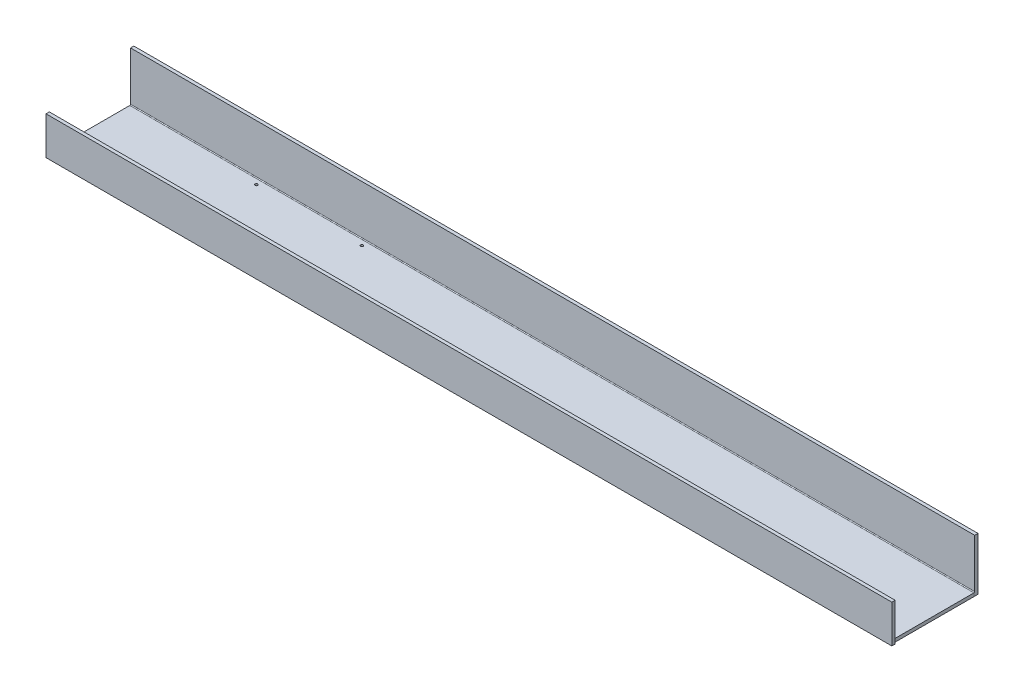
ISO-10303-21;
HEADER;
FILE_DESCRIPTION(('STEP AP214'),'2;1');
FILE_NAME('part.step','',(''),(''),'','','');
FILE_SCHEMA(('AUTOMOTIVE_DESIGN { 1 0 10303 214 1 1 1 1 }'));
ENDSEC;
DATA;
#1=APPLICATION_CONTEXT('core data for automotive mechanical design processes');
#2=APPLICATION_PROTOCOL_DEFINITION('international standard','automotive_design',2000,#1);
#3=PRODUCT_CONTEXT('',#1,'mechanical');
#4=PRODUCT('Part','Part','',(#3));
#5=PRODUCT_RELATED_PRODUCT_CATEGORY('part','',(#4));
#6=PRODUCT_DEFINITION_FORMATION('','',#4);
#7=PRODUCT_DEFINITION_CONTEXT('part definition',#1,'design');
#8=PRODUCT_DEFINITION('design','',#6,#7);
#9=PRODUCT_DEFINITION_SHAPE('','',#8);
#10=(LENGTH_UNIT() NAMED_UNIT(*) SI_UNIT(.MILLI.,.METRE.));
#11=(NAMED_UNIT(*) PLANE_ANGLE_UNIT() SI_UNIT($,.RADIAN.));
#12=(NAMED_UNIT(*) SI_UNIT($,.STERADIAN.) SOLID_ANGLE_UNIT());
#13=UNCERTAINTY_MEASURE_WITH_UNIT(LENGTH_MEASURE(1.E-05),#10,'distance_accuracy_value','');
#14=(GEOMETRIC_REPRESENTATION_CONTEXT(3) GLOBAL_UNCERTAINTY_ASSIGNED_CONTEXT((#13)) GLOBAL_UNIT_ASSIGNED_CONTEXT((#10,
#11,#12)) REPRESENTATION_CONTEXT('',''));
#15=CARTESIAN_POINT('',(0.,0.,0.));
#16=DIRECTION('',(0.,0.,1.));
#17=DIRECTION('',(1.,0.,0.));
#18=AXIS2_PLACEMENT_3D('',#15,#16,#17);
#19=CARTESIAN_POINT('',(812.8,3.937,-0.761999999999999));
#20=DIRECTION('',(-1.,0.,0.));
#21=DIRECTION('',(0.,0.,1.));
#22=AXIS2_PLACEMENT_3D('',#19,#20,#21);
#23=PLANE('',#22);
#24=CARTESIAN_POINT('',(812.8,3.937,-0.761999999999999));
#25=DIRECTION('',(1.,0.,0.));
#26=DIRECTION('',(0.,0.,-1.));
#27=AXIS2_PLACEMENT_3D('',#24,#25,#26);
#28=CIRCLE('',#27,0.761999999999999);
#29=CARTESIAN_POINT('',(812.8,3.937,0.));
#30=VERTEX_POINT('',#29);
#31=CARTESIAN_POINT('',(812.8,3.175,-0.761999999999999));
#32=VERTEX_POINT('',#31);
#33=EDGE_CURVE('E259',#30,#32,#28,.T.);
#34=ORIENTED_EDGE('',*,*,#33,.F.);
#35=DIRECTION('',(0.,1.,0.));
#36=VECTOR('',#35,1.);
#37=CARTESIAN_POINT('',(812.8,3.937,0.));
#38=LINE('',#37,#36);
#39=CARTESIAN_POINT('',(812.8,0.0744457932606293,0.));
#40=VERTEX_POINT('',#39);
#41=EDGE_CURVE('E197',#30,#40,#38,.F.);
#42=ORIENTED_EDGE('',*,*,#41,.T.);
#43=CARTESIAN_POINT('',(812.8,3.937,-0.761999999999999));
#44=DIRECTION('',(1.,0.,0.));
#45=DIRECTION('',(0.,0.,-1.));
#46=AXIS2_PLACEMENT_3D('',#43,#44,#45);
#47=CIRCLE('',#46,3.937);
#48=CARTESIAN_POINT('',(812.8,0.,-0.761999999999998));
#49=VERTEX_POINT('',#48);
#50=EDGE_CURVE('E265',#40,#49,#47,.T.);
#51=ORIENTED_EDGE('',*,*,#50,.T.);
#52=DIRECTION('',(0.,-1.,0.));
#53=VECTOR('',#52,1.);
#54=CARTESIAN_POINT('',(812.8,3.175,-0.761999999999999));
#55=LINE('',#54,#53);
#56=EDGE_CURVE('E268',#32,#49,#55,.T.);
#57=ORIENTED_EDGE('',*,*,#56,.F.);
#58=EDGE_LOOP('',(#34,#42,#51,#57));
#59=FACE_BOUND('',#58,.T.);
#60=ADVANCED_FACE('F39',(#59),#23,.F.);
#61=CARTESIAN_POINT('',(812.8,3.937,-0.761999999999999));
#62=DIRECTION('',(1.,0.,0.));
#63=DIRECTION('',(0.,0.,1.));
#64=AXIS2_PLACEMENT_3D('',#61,#62,#63);
#65=CYLINDRICAL_SURFACE('',#64,3.937);
#66=ORIENTED_EDGE('',*,*,#50,.F.);
#67=DIRECTION('',(1.,0.,0.));
#68=VECTOR('',#67,1.);
#69=CARTESIAN_POINT('',(812.8,0.0744457932606293,0.));
#70=LINE('',#69,#68);
#71=CARTESIAN_POINT('',(0.,0.0744457932606293,0.));
#72=VERTEX_POINT('',#71);
#73=EDGE_CURVE('E190',#40,#72,#70,.F.);
#74=ORIENTED_EDGE('',*,*,#73,.T.);
#75=CARTESIAN_POINT('',(0.,3.937,-0.761999999999999));
#76=DIRECTION('',(1.,0.,0.));
#77=DIRECTION('',(0.,0.,-1.));
#78=AXIS2_PLACEMENT_3D('',#75,#76,#77);
#79=CIRCLE('',#78,3.937);
#80=CARTESIAN_POINT('',(0.,0.,-0.761999999999998));
#81=VERTEX_POINT('',#80);
#82=EDGE_CURVE('E264',#81,#72,#79,.F.);
#83=ORIENTED_EDGE('',*,*,#82,.F.);
#84=DIRECTION('',(1.,0.,0.));
#85=VECTOR('',#84,1.);
#86=CARTESIAN_POINT('',(812.8,0.,-0.761999999999998));
#87=LINE('',#86,#85);
#88=EDGE_CURVE('E261',#49,#81,#87,.F.);
#89=ORIENTED_EDGE('',*,*,#88,.F.);
#90=EDGE_LOOP('',(#66,#74,#83,#89));
#91=FACE_BOUND('',#90,.T.);
#92=ADVANCED_FACE('F333',(#91),#65,.T.);
#93=CARTESIAN_POINT('',(0.,3.175,-78.232));
#94=DIRECTION('',(0.,-1.,0.));
#95=DIRECTION('',(0.,0.,-1.));
#96=AXIS2_PLACEMENT_3D('',#93,#94,#95);
#97=PLANE('',#96);
#98=CARTESIAN_POINT('',(127.,3.175,-5.84200000000001));
#99=DIRECTION('',(0.,1.,0.));
#100=DIRECTION('',(0.,0.,1.));
#101=AXIS2_PLACEMENT_3D('',#98,#99,#100);
#102=CIRCLE('',#101,1.27);
#103=CARTESIAN_POINT('',(127.,3.175,-4.57200000000001));
#104=VERTEX_POINT('',#103);
#105=EDGE_CURVE('E230',#104,#104,#102,.T.);
#106=ORIENTED_EDGE('',*,*,#105,.F.);
#107=EDGE_LOOP('',(#106));
#108=FACE_BOUND('',#107,.T.);
#109=CARTESIAN_POINT('',(228.6,3.175,-5.84200000000001));
#110=DIRECTION('',(0.,1.,0.));
#111=DIRECTION('',(0.,0.,1.));
#112=AXIS2_PLACEMENT_3D('',#109,#110,#111);
#113=CIRCLE('',#112,1.26999999999997);
#114=CARTESIAN_POINT('',(228.6,3.175,-4.57200000000004));
#115=VERTEX_POINT('',#114);
#116=EDGE_CURVE('E234',#115,#115,#113,.T.);
#117=ORIENTED_EDGE('',*,*,#116,.F.);
#118=EDGE_LOOP('',(#117));
#119=FACE_BOUND('',#118,.T.);
#120=CARTESIAN_POINT('',(228.6,3.175,-72.39));
#121=DIRECTION('',(0.,1.,0.));
#122=DIRECTION('',(0.,0.,1.));
#123=AXIS2_PLACEMENT_3D('',#120,#121,#122);
#124=CIRCLE('',#123,1.26999999999998);
#125=CARTESIAN_POINT('',(228.6,3.175,-71.12));
#126=VERTEX_POINT('',#125);
#127=EDGE_CURVE('E240',#126,#126,#124,.T.);
#128=ORIENTED_EDGE('',*,*,#127,.F.);
#129=EDGE_LOOP('',(#128));
#130=FACE_BOUND('',#129,.T.);
#131=CARTESIAN_POINT('',(127.,3.175,-72.39));
#132=DIRECTION('',(0.,1.,0.));
#133=DIRECTION('',(0.,0.,1.));
#134=AXIS2_PLACEMENT_3D('',#131,#132,#133);
#135=CIRCLE('',#134,1.27000000000001);
#136=CARTESIAN_POINT('',(127.,3.175,-71.12));
#137=VERTEX_POINT('',#136);
#138=EDGE_CURVE('E246',#137,#137,#135,.T.);
#139=ORIENTED_EDGE('',*,*,#138,.F.);
#140=EDGE_LOOP('',(#139));
#141=FACE_BOUND('',#140,.T.);
#142=DIRECTION('',(1.,0.,0.));
#143=VECTOR('',#142,1.);
#144=CARTESIAN_POINT('',(812.8,3.175,-0.761999999999999));
#145=LINE('',#144,#143);
#146=CARTESIAN_POINT('',(0.,3.175,-0.761999999999999));
#147=VERTEX_POINT('',#146);
#148=EDGE_CURVE('E273',#32,#147,#145,.F.);
#149=ORIENTED_EDGE('',*,*,#148,.F.);
#150=DIRECTION('',(0.,0.,-1.));
#151=VECTOR('',#150,1.);
#152=CARTESIAN_POINT('',(812.8,3.175,0.));
#153=LINE('',#152,#151);
#154=CARTESIAN_POINT('',(812.8,3.17499999999999,-77.47));
#155=VERTEX_POINT('',#154);
#156=EDGE_CURVE('E11',#32,#155,#153,.T.);
#157=ORIENTED_EDGE('',*,*,#156,.T.);
#158=DIRECTION('',(-1.,0.,0.));
#159=VECTOR('',#158,1.);
#160=CARTESIAN_POINT('',(0.,3.17499999999999,-77.47));
#161=LINE('',#160,#159);
#162=CARTESIAN_POINT('',(2.22044604925031E-13,3.17499999999999,-77.47));
#163=VERTEX_POINT('',#162);
#164=EDGE_CURVE('E303',#163,#155,#161,.F.);
#165=ORIENTED_EDGE('',*,*,#164,.F.);
#166=DIRECTION('',(0.,0.,1.));
#167=VECTOR('',#166,1.);
#168=CARTESIAN_POINT('',(0.,3.175,0.));
#169=LINE('',#168,#167);
#170=EDGE_CURVE('E48',#163,#147,#169,.T.);
#171=ORIENTED_EDGE('',*,*,#170,.T.);
#172=EDGE_LOOP('',(#149,#157,#165,#171));
#173=FACE_BOUND('',#172,.T.);
#174=ADVANCED_FACE('F342',(#108,#119,#130,#141,#173),#97,.F.);
#175=CARTESIAN_POINT('',(0.,0.,-78.232));
#176=DIRECTION('',(0.,-1.,0.));
#177=DIRECTION('',(0.,0.,-1.));
#178=AXIS2_PLACEMENT_3D('',#175,#176,#177);
#179=PLANE('',#178);
#180=CARTESIAN_POINT('',(127.,0.,-5.84200000000001));
#181=DIRECTION('',(0.,1.,0.));
#182=DIRECTION('',(0.,0.,1.));
#183=AXIS2_PLACEMENT_3D('',#180,#181,#182);
#184=CIRCLE('',#183,1.27);
#185=CARTESIAN_POINT('',(127.,0.,-4.57200000000001));
#186=VERTEX_POINT('',#185);
#187=EDGE_CURVE('E231',#186,#186,#184,.T.);
#188=ORIENTED_EDGE('',*,*,#187,.T.);
#189=EDGE_LOOP('',(#188));
#190=FACE_BOUND('',#189,.T.);
#191=CARTESIAN_POINT('',(228.6,0.,-5.84200000000001));
#192=DIRECTION('',(0.,1.,0.));
#193=DIRECTION('',(0.,0.,1.));
#194=AXIS2_PLACEMENT_3D('',#191,#192,#193);
#195=CIRCLE('',#194,1.26999999999997);
#196=CARTESIAN_POINT('',(228.6,0.,-4.57200000000004));
#197=VERTEX_POINT('',#196);
#198=EDGE_CURVE('E237',#197,#197,#195,.T.);
#199=ORIENTED_EDGE('',*,*,#198,.T.);
#200=EDGE_LOOP('',(#199));
#201=FACE_BOUND('',#200,.T.);
#202=CARTESIAN_POINT('',(228.6,0.,-72.39));
#203=DIRECTION('',(0.,1.,0.));
#204=DIRECTION('',(0.,0.,1.));
#205=AXIS2_PLACEMENT_3D('',#202,#203,#204);
#206=CIRCLE('',#205,1.26999999999998);
#207=CARTESIAN_POINT('',(228.6,0.,-71.12));
#208=VERTEX_POINT('',#207);
#209=EDGE_CURVE('E243',#208,#208,#206,.T.);
#210=ORIENTED_EDGE('',*,*,#209,.T.);
#211=EDGE_LOOP('',(#210));
#212=FACE_BOUND('',#211,.T.);
#213=CARTESIAN_POINT('',(127.,0.,-72.39));
#214=DIRECTION('',(0.,1.,0.));
#215=DIRECTION('',(0.,0.,1.));
#216=AXIS2_PLACEMENT_3D('',#213,#214,#215);
#217=CIRCLE('',#216,1.27000000000001);
#218=CARTESIAN_POINT('',(127.,0.,-71.12));
#219=VERTEX_POINT('',#218);
#220=EDGE_CURVE('E249',#219,#219,#217,.T.);
#221=ORIENTED_EDGE('',*,*,#220,.T.);
#222=EDGE_LOOP('',(#221));
#223=FACE_BOUND('',#222,.T.);
#224=DIRECTION('',(0.,0.,-1.));
#225=VECTOR('',#224,1.);
#226=CARTESIAN_POINT('',(812.8,0.,-78.232));
#227=LINE('',#226,#225);
#228=CARTESIAN_POINT('',(812.8,0.,-77.47));
#229=VERTEX_POINT('',#228);
#230=EDGE_CURVE('E43',#49,#229,#227,.T.);
#231=ORIENTED_EDGE('',*,*,#230,.F.);
#232=ORIENTED_EDGE('',*,*,#88,.T.);
#233=DIRECTION('',(0.,0.,-1.));
#234=VECTOR('',#233,1.);
#235=CARTESIAN_POINT('',(0.,0.,-78.232));
#236=LINE('',#235,#234);
#237=CARTESIAN_POINT('',(2.22044604925031E-13,0.,-77.47));
#238=VERTEX_POINT('',#237);
#239=EDGE_CURVE('E311',#238,#81,#236,.F.);
#240=ORIENTED_EDGE('',*,*,#239,.F.);
#241=DIRECTION('',(-1.,0.,0.));
#242=VECTOR('',#241,1.);
#243=CARTESIAN_POINT('',(0.,0.,-77.47));
#244=LINE('',#243,#242);
#245=EDGE_CURVE('E293',#238,#229,#244,.F.);
#246=ORIENTED_EDGE('',*,*,#245,.T.);
#247=EDGE_LOOP('',(#231,#232,#240,#246));
#248=FACE_BOUND('',#247,.T.);
#249=ADVANCED_FACE('F329',(#190,#201,#212,#223,#248),#179,.T.);
#250=CARTESIAN_POINT('',(812.8,3.175,0.));
#251=DIRECTION('',(-1.,0.,0.));
#252=DIRECTION('',(0.,0.,-1.));
#253=AXIS2_PLACEMENT_3D('',#250,#251,#252);
#254=PLANE('',#253);
#255=ORIENTED_EDGE('',*,*,#156,.F.);
#256=ORIENTED_EDGE('',*,*,#56,.T.);
#257=ORIENTED_EDGE('',*,*,#230,.T.);
#258=DIRECTION('',(0.,-1.,0.));
#259=VECTOR('',#258,1.);
#260=CARTESIAN_POINT('',(812.8,3.17499999999999,-77.47));
#261=LINE('',#260,#259);
#262=EDGE_CURVE('E308',#155,#229,#261,.T.);
#263=ORIENTED_EDGE('',*,*,#262,.F.);
#264=EDGE_LOOP('',(#255,#256,#257,#263));
#265=FACE_BOUND('',#264,.T.);
#266=ADVANCED_FACE('F41',(#265),#254,.F.);
#267=CARTESIAN_POINT('',(0.,3.175,0.));
#268=DIRECTION('',(1.,0.,0.));
#269=DIRECTION('',(0.,0.,1.));
#270=AXIS2_PLACEMENT_3D('',#267,#268,#269);
#271=PLANE('',#270);
#272=DIRECTION('',(0.,-1.,0.));
#273=VECTOR('',#272,1.);
#274=CARTESIAN_POINT('',(0.,3.175,-0.761999999999999));
#275=LINE('',#274,#273);
#276=EDGE_CURVE('E277',#147,#81,#275,.T.);
#277=ORIENTED_EDGE('',*,*,#276,.F.);
#278=ORIENTED_EDGE('',*,*,#170,.F.);
#279=DIRECTION('',(0.,-1.,0.));
#280=VECTOR('',#279,1.);
#281=CARTESIAN_POINT('',(2.22044604925031E-13,3.17499999999999,-77.47));
#282=LINE('',#281,#280);
#283=EDGE_CURVE('E298',#163,#238,#282,.T.);
#284=ORIENTED_EDGE('',*,*,#283,.T.);
#285=ORIENTED_EDGE('',*,*,#239,.T.);
#286=EDGE_LOOP('',(#277,#278,#284,#285));
#287=FACE_BOUND('',#286,.T.);
#288=ADVANCED_FACE('F338',(#287),#271,.F.);
#289=CARTESIAN_POINT('',(812.8,3.93699999999998,-77.47));
#290=DIRECTION('',(1.,0.,0.));
#291=DIRECTION('',(0.,0.,-1.));
#292=AXIS2_PLACEMENT_3D('',#289,#290,#291);
#293=PLANE('',#292);
#294=CARTESIAN_POINT('',(812.8,3.93699999999998,-77.47));
#295=DIRECTION('',(-1.,0.,0.));
#296=DIRECTION('',(0.,0.,1.));
#297=AXIS2_PLACEMENT_3D('',#294,#295,#296);
#298=CIRCLE('',#297,3.937);
#299=CARTESIAN_POINT('',(812.8,0.0744457932606128,-78.232));
#300=VERTEX_POINT('',#299);
#301=EDGE_CURVE('E296',#229,#300,#298,.F.);
#302=ORIENTED_EDGE('',*,*,#301,.T.);
#303=DIRECTION('',(0.,-1.,0.));
#304=VECTOR('',#303,1.);
#305=CARTESIAN_POINT('',(812.8,0.,-78.232));
#306=LINE('',#305,#304);
#307=CARTESIAN_POINT('',(812.8,0.,-78.232));
#308=VERTEX_POINT('',#307);
#309=EDGE_CURVE('E201',#300,#308,#306,.T.);
#310=ORIENTED_EDGE('',*,*,#309,.T.);
#311=DIRECTION('',(0.,0.,-1.));
#312=VECTOR('',#311,1.);
#313=CARTESIAN_POINT('',(812.8,0.,-78.232));
#314=LINE('',#313,#312);
#315=CARTESIAN_POINT('',(812.8,0.,-81.407));
#316=VERTEX_POINT('',#315);
#317=EDGE_CURVE('E213',#308,#316,#314,.T.);
#318=ORIENTED_EDGE('',*,*,#317,.T.);
#319=DIRECTION('',(0.,-1.,0.));
#320=VECTOR('',#319,1.);
#321=CARTESIAN_POINT('',(812.8,3.17499999999999,-81.407));
#322=LINE('',#321,#320);
#323=CARTESIAN_POINT('',(812.8,50.8,-81.4070000000002));
#324=VERTEX_POINT('',#323);
#325=EDGE_CURVE('E285',#324,#316,#322,.T.);
#326=ORIENTED_EDGE('',*,*,#325,.F.);
#327=DIRECTION('',(0.,0.,-1.));
#328=VECTOR('',#327,1.);
#329=CARTESIAN_POINT('',(812.8,50.8,-78.2320000000002));
#330=LINE('',#329,#328);
#331=CARTESIAN_POINT('',(812.8,50.8,-78.2320000000002));
#332=VERTEX_POINT('',#331);
#333=EDGE_CURVE('E218',#332,#324,#330,.T.);
#334=ORIENTED_EDGE('',*,*,#333,.F.);
#335=DIRECTION('',(0.,-1.,0.));
#336=VECTOR('',#335,1.);
#337=CARTESIAN_POINT('',(812.8,3.175,-78.232));
#338=LINE('',#337,#336);
#339=CARTESIAN_POINT('',(812.8,3.93699999999998,-78.232));
#340=VERTEX_POINT('',#339);
#341=EDGE_CURVE('E284',#332,#340,#338,.T.);
#342=ORIENTED_EDGE('',*,*,#341,.T.);
#343=CARTESIAN_POINT('',(812.8,3.93699999999998,-77.47));
#344=DIRECTION('',(-1.,0.,0.));
#345=DIRECTION('',(0.,0.,1.));
#346=AXIS2_PLACEMENT_3D('',#343,#344,#345);
#347=CIRCLE('',#346,0.761999999999999);
#348=EDGE_CURVE('E300',#155,#340,#347,.F.);
#349=ORIENTED_EDGE('',*,*,#348,.F.);
#350=ORIENTED_EDGE('',*,*,#262,.T.);
#351=EDGE_LOOP('',(#302,#310,#318,#326,#334,#342,#349,#350));
#352=FACE_BOUND('',#351,.T.);
#353=ADVANCED_FACE('F328',(#352),#293,.T.);
#354=CARTESIAN_POINT('',(2.22044604925031E-13,3.93699999999998,-77.47));
#355=DIRECTION('',(1.,0.,0.));
#356=DIRECTION('',(0.,0.,-1.));
#357=AXIS2_PLACEMENT_3D('',#354,#355,#356);
#358=PLANE('',#357);
#359=CARTESIAN_POINT('',(2.22044604925031E-13,3.93699999999998,-77.47));
#360=DIRECTION('',(-1.,0.,0.));
#361=DIRECTION('',(0.,0.,1.));
#362=AXIS2_PLACEMENT_3D('',#359,#360,#361);
#363=CIRCLE('',#362,0.761999999999999);
#364=CARTESIAN_POINT('',(2.22044604925031E-13,3.93699999999998,-78.232));
#365=VERTEX_POINT('',#364);
#366=EDGE_CURVE('E290',#365,#163,#363,.T.);
#367=ORIENTED_EDGE('',*,*,#366,.F.);
#368=DIRECTION('',(0.,1.,0.));
#369=VECTOR('',#368,1.);
#370=CARTESIAN_POINT('',(0.,26.543,-78.2320000000001));
#371=LINE('',#370,#369);
#372=CARTESIAN_POINT('',(0.,50.8,-78.2320000000002));
#373=VERTEX_POINT('',#372);
#374=EDGE_CURVE('E288',#365,#373,#371,.T.);
#375=ORIENTED_EDGE('',*,*,#374,.T.);
#376=DIRECTION('',(0.,0.,-1.));
#377=VECTOR('',#376,1.);
#378=CARTESIAN_POINT('',(0.,50.8,-78.2320000000002));
#379=LINE('',#378,#377);
#380=CARTESIAN_POINT('',(0.,50.8,-81.4070000000002));
#381=VERTEX_POINT('',#380);
#382=EDGE_CURVE('E221',#373,#381,#379,.T.);
#383=ORIENTED_EDGE('',*,*,#382,.T.);
#384=DIRECTION('',(0.,1.,0.));
#385=VECTOR('',#384,1.);
#386=CARTESIAN_POINT('',(0.,26.543,-81.4070000000001));
#387=LINE('',#386,#385);
#388=CARTESIAN_POINT('',(0.,0.,-81.407));
#389=VERTEX_POINT('',#388);
#390=EDGE_CURVE('E287',#389,#381,#387,.T.);
#391=ORIENTED_EDGE('',*,*,#390,.F.);
#392=DIRECTION('',(0.,0.,-1.));
#393=VECTOR('',#392,1.);
#394=CARTESIAN_POINT('',(0.,0.,-78.232));
#395=LINE('',#394,#393);
#396=CARTESIAN_POINT('',(0.,0.,-78.232));
#397=VERTEX_POINT('',#396);
#398=EDGE_CURVE('E224',#397,#389,#395,.T.);
#399=ORIENTED_EDGE('',*,*,#398,.F.);
#400=DIRECTION('',(0.,1.,0.));
#401=VECTOR('',#400,1.);
#402=CARTESIAN_POINT('',(0.,0.,-78.232));
#403=LINE('',#402,#401);
#404=CARTESIAN_POINT('',(2.22044604925031E-13,0.0744457932606128,-78.232));
#405=VERTEX_POINT('',#404);
#406=EDGE_CURVE('E207',#397,#405,#403,.T.);
#407=ORIENTED_EDGE('',*,*,#406,.T.);
#408=CARTESIAN_POINT('',(2.22044604925031E-13,3.93699999999998,-77.47));
#409=DIRECTION('',(-1.,0.,0.));
#410=DIRECTION('',(0.,0.,1.));
#411=AXIS2_PLACEMENT_3D('',#408,#409,#410);
#412=CIRCLE('',#411,3.937);
#413=EDGE_CURVE('E61',#405,#238,#412,.T.);
#414=ORIENTED_EDGE('',*,*,#413,.T.);
#415=ORIENTED_EDGE('',*,*,#283,.F.);
#416=EDGE_LOOP('',(#367,#375,#383,#391,#399,#407,#414,#415));
#417=FACE_BOUND('',#416,.T.);
#418=ADVANCED_FACE('F349',(#417),#358,.F.);
#419=CARTESIAN_POINT('',(0.,3.93699999999998,-77.47));
#420=DIRECTION('',(-1.,0.,0.));
#421=DIRECTION('',(0.,0.,-1.));
#422=AXIS2_PLACEMENT_3D('',#419,#420,#421);
#423=CYLINDRICAL_SURFACE('',#422,3.937);
#424=DIRECTION('',(-1.,0.,0.));
#425=VECTOR('',#424,1.);
#426=CARTESIAN_POINT('',(0.,0.0744457932606128,-78.232));
#427=LINE('',#426,#425);
#428=EDGE_CURVE('E56',#300,#405,#427,.T.);
#429=ORIENTED_EDGE('',*,*,#428,.F.);
#430=ORIENTED_EDGE('',*,*,#301,.F.);
#431=ORIENTED_EDGE('',*,*,#245,.F.);
#432=ORIENTED_EDGE('',*,*,#413,.F.);
#433=EDGE_LOOP('',(#429,#430,#431,#432));
#434=FACE_BOUND('',#433,.T.);
#435=ADVANCED_FACE('F324',(#434),#423,.T.);
#436=CARTESIAN_POINT('',(0.,3.93699999999998,-77.47));
#437=DIRECTION('',(-1.,0.,0.));
#438=DIRECTION('',(0.,0.,-1.));
#439=AXIS2_PLACEMENT_3D('',#436,#437,#438);
#440=CYLINDRICAL_SURFACE('',#439,0.761999999999999);
#441=ORIENTED_EDGE('',*,*,#164,.T.);
#442=ORIENTED_EDGE('',*,*,#348,.T.);
#443=DIRECTION('',(-1.,0.,0.));
#444=VECTOR('',#443,1.);
#445=CARTESIAN_POINT('',(812.8,3.937,-78.232));
#446=LINE('',#445,#444);
#447=EDGE_CURVE('E280',#340,#365,#446,.T.);
#448=ORIENTED_EDGE('',*,*,#447,.T.);
#449=ORIENTED_EDGE('',*,*,#366,.T.);
#450=EDGE_LOOP('',(#441,#442,#448,#449));
#451=FACE_BOUND('',#450,.T.);
#452=ADVANCED_FACE('F344',(#451),#440,.F.);
#453=CARTESIAN_POINT('',(812.8,26.543,-81.4070000000001));
#454=DIRECTION('',(0.,0.,1.));
#455=DIRECTION('',(0.,-1.,0.));
#456=AXIS2_PLACEMENT_3D('',#453,#454,#455);
#457=PLANE('',#456);
#458=ORIENTED_EDGE('',*,*,#390,.T.);
#459=DIRECTION('',(1.,0.,0.));
#460=VECTOR('',#459,1.);
#461=CARTESIAN_POINT('',(812.8,50.8,-81.4070000000002));
#462=LINE('',#461,#460);
#463=EDGE_CURVE('E204',#381,#324,#462,.T.);
#464=ORIENTED_EDGE('',*,*,#463,.T.);
#465=ORIENTED_EDGE('',*,*,#325,.T.);
#466=DIRECTION('',(-1.,0.,0.));
#467=VECTOR('',#466,1.);
#468=CARTESIAN_POINT('',(812.8,0.,-81.407));
#469=LINE('',#468,#467);
#470=EDGE_CURVE('E200',#316,#389,#469,.T.);
#471=ORIENTED_EDGE('',*,*,#470,.T.);
#472=EDGE_LOOP('',(#458,#464,#465,#471));
#473=FACE_BOUND('',#472,.T.);
#474=ADVANCED_FACE('F365',(#473),#457,.F.);
#475=CARTESIAN_POINT('',(812.8,26.543,-78.2320000000001));
#476=DIRECTION('',(0.,0.,1.));
#477=DIRECTION('',(0.,-1.,0.));
#478=AXIS2_PLACEMENT_3D('',#475,#476,#477);
#479=PLANE('',#478);
#480=DIRECTION('',(1.,0.,0.));
#481=VECTOR('',#480,1.);
#482=CARTESIAN_POINT('',(812.8,50.8,-78.2320000000002));
#483=LINE('',#482,#481);
#484=EDGE_CURVE('E210',#373,#332,#483,.T.);
#485=ORIENTED_EDGE('',*,*,#484,.F.);
#486=ORIENTED_EDGE('',*,*,#374,.F.);
#487=ORIENTED_EDGE('',*,*,#447,.F.);
#488=ORIENTED_EDGE('',*,*,#341,.F.);
#489=EDGE_LOOP('',(#485,#486,#487,#488));
#490=FACE_BOUND('',#489,.T.);
#491=ADVANCED_FACE('F353',(#490),#479,.T.);
#492=CARTESIAN_POINT('',(0.,3.937,-0.761999999999999));
#493=DIRECTION('',(-1.,0.,0.));
#494=DIRECTION('',(0.,0.,1.));
#495=AXIS2_PLACEMENT_3D('',#492,#493,#494);
#496=PLANE('',#495);
#497=DIRECTION('',(0.,0.,1.));
#498=VECTOR('',#497,1.);
#499=CARTESIAN_POINT('',(0.,0.,0.));
#500=LINE('',#499,#498);
#501=CARTESIAN_POINT('',(0.,0.,0.));
#502=VERTEX_POINT('',#501);
#503=CARTESIAN_POINT('',(0.,0.,3.175));
#504=VERTEX_POINT('',#503);
#505=EDGE_CURVE('E191',#502,#504,#500,.T.);
#506=ORIENTED_EDGE('',*,*,#505,.T.);
#507=DIRECTION('',(0.,-1.,0.));
#508=VECTOR('',#507,1.);
#509=CARTESIAN_POINT('',(0.,3.175,3.175));
#510=LINE('',#509,#508);
#511=CARTESIAN_POINT('',(2.22044604925031E-13,36.576,3.175));
#512=VERTEX_POINT('',#511);
#513=EDGE_CURVE('E257',#512,#504,#510,.T.);
#514=ORIENTED_EDGE('',*,*,#513,.F.);
#515=DIRECTION('',(0.,0.,1.));
#516=VECTOR('',#515,1.);
#517=CARTESIAN_POINT('',(2.22044604925031E-13,36.576,0.));
#518=LINE('',#517,#516);
#519=CARTESIAN_POINT('',(2.22044604925031E-13,36.576,0.));
#520=VERTEX_POINT('',#519);
#521=EDGE_CURVE('E163',#520,#512,#518,.T.);
#522=ORIENTED_EDGE('',*,*,#521,.F.);
#523=DIRECTION('',(0.,-1.,0.));
#524=VECTOR('',#523,1.);
#525=CARTESIAN_POINT('',(0.,3.175,0.));
#526=LINE('',#525,#524);
#527=CARTESIAN_POINT('',(0.,3.937,0.));
#528=VERTEX_POINT('',#527);
#529=EDGE_CURVE('E173',#520,#528,#526,.T.);
#530=ORIENTED_EDGE('',*,*,#529,.T.);
#531=CARTESIAN_POINT('',(0.,3.937,-0.761999999999999));
#532=DIRECTION('',(1.,0.,0.));
#533=DIRECTION('',(0.,0.,-1.));
#534=AXIS2_PLACEMENT_3D('',#531,#532,#533);
#535=CIRCLE('',#534,0.761999999999999);
#536=EDGE_CURVE('E270',#147,#528,#535,.F.);
#537=ORIENTED_EDGE('',*,*,#536,.F.);
#538=ORIENTED_EDGE('',*,*,#276,.T.);
#539=ORIENTED_EDGE('',*,*,#82,.T.);
#540=DIRECTION('',(0.,-1.,0.));
#541=VECTOR('',#540,1.);
#542=CARTESIAN_POINT('',(0.,0.,0.));
#543=LINE('',#542,#541);
#544=EDGE_CURVE('E175',#72,#502,#543,.T.);
#545=ORIENTED_EDGE('',*,*,#544,.T.);
#546=EDGE_LOOP('',(#506,#514,#522,#530,#537,#538,#539,#545));
#547=FACE_BOUND('',#546,.T.);
#548=ADVANCED_FACE('F336',(#547),#496,.T.);
#549=CARTESIAN_POINT('',(812.8,3.937,-0.761999999999999));
#550=DIRECTION('',(1.,0.,0.));
#551=DIRECTION('',(0.,0.,1.));
#552=AXIS2_PLACEMENT_3D('',#549,#550,#551);
#553=CYLINDRICAL_SURFACE('',#552,0.761999999999999);
#554=ORIENTED_EDGE('',*,*,#148,.T.);
#555=ORIENTED_EDGE('',*,*,#536,.T.);
#556=DIRECTION('',(1.,0.,0.));
#557=VECTOR('',#556,1.);
#558=CARTESIAN_POINT('',(0.,3.937,0.));
#559=LINE('',#558,#557);
#560=EDGE_CURVE('E252',#528,#30,#559,.T.);
#561=ORIENTED_EDGE('',*,*,#560,.T.);
#562=ORIENTED_EDGE('',*,*,#33,.T.);
#563=EDGE_LOOP('',(#554,#555,#561,#562));
#564=FACE_BOUND('',#563,.T.);
#565=ADVANCED_FACE('F483',(#564),#553,.F.);
#566=CARTESIAN_POINT('',(0.,26.543,3.175));
#567=DIRECTION('',(0.,0.,-1.));
#568=DIRECTION('',(-1.,0.,0.));
#569=AXIS2_PLACEMENT_3D('',#566,#567,#568);
#570=PLANE('',#569);
#571=ORIENTED_EDGE('',*,*,#513,.T.);
#572=DIRECTION('',(1.,0.,0.));
#573=VECTOR('',#572,1.);
#574=CARTESIAN_POINT('',(814.386282526596,0.,3.175));
#575=LINE('',#574,#573);
#576=CARTESIAN_POINT('',(814.386282526596,0.,3.175));
#577=VERTEX_POINT('',#576);
#578=EDGE_CURVE('E179',#504,#577,#575,.T.);
#579=ORIENTED_EDGE('',*,*,#578,.T.);
#580=DIRECTION('',(0.,1.,0.));
#581=VECTOR('',#580,1.);
#582=CARTESIAN_POINT('',(814.386282526596,0.,3.175));
#583=LINE('',#582,#581);
#584=CARTESIAN_POINT('',(814.386282526596,36.5760000000001,3.175));
#585=VERTEX_POINT('',#584);
#586=EDGE_CURVE('E186',#577,#585,#583,.T.);
#587=ORIENTED_EDGE('',*,*,#586,.T.);
#588=DIRECTION('',(-1.,0.,0.));
#589=VECTOR('',#588,1.);
#590=CARTESIAN_POINT('',(814.386282526596,36.5760000000001,3.175));
#591=LINE('',#590,#589);
#592=EDGE_CURVE('E158',#585,#512,#591,.T.);
#593=ORIENTED_EDGE('',*,*,#592,.T.);
#594=EDGE_LOOP('',(#571,#579,#587,#593));
#595=FACE_BOUND('',#594,.T.);
#596=ADVANCED_FACE('F491',(#595),#570,.F.);
#597=CARTESIAN_POINT('',(0.,26.543,0.));
#598=DIRECTION('',(0.,0.,-1.));
#599=DIRECTION('',(-1.,0.,0.));
#600=AXIS2_PLACEMENT_3D('',#597,#598,#599);
#601=PLANE('',#600);
#602=ORIENTED_EDGE('',*,*,#529,.F.);
#603=DIRECTION('',(-1.,0.,0.));
#604=VECTOR('',#603,1.);
#605=CARTESIAN_POINT('',(814.386282526596,36.5760000000001,0.));
#606=LINE('',#605,#604);
#607=CARTESIAN_POINT('',(814.386282526596,36.5760000000001,0.));
#608=VERTEX_POINT('',#607);
#609=EDGE_CURVE('E156',#608,#520,#606,.T.);
#610=ORIENTED_EDGE('',*,*,#609,.F.);
#611=DIRECTION('',(0.,1.,0.));
#612=VECTOR('',#611,1.);
#613=CARTESIAN_POINT('',(814.386282526596,0.,0.));
#614=LINE('',#613,#612);
#615=CARTESIAN_POINT('',(814.386282526596,0.,0.));
#616=VERTEX_POINT('',#615);
#617=EDGE_CURVE('E170',#616,#608,#614,.T.);
#618=ORIENTED_EDGE('',*,*,#617,.F.);
#619=DIRECTION('',(1.,0.,0.));
#620=VECTOR('',#619,1.);
#621=CARTESIAN_POINT('',(814.386282526596,0.,0.));
#622=LINE('',#621,#620);
#623=EDGE_CURVE('E164',#502,#616,#622,.T.);
#624=ORIENTED_EDGE('',*,*,#623,.F.);
#625=ORIENTED_EDGE('',*,*,#544,.F.);
#626=ORIENTED_EDGE('',*,*,#73,.F.);
#627=ORIENTED_EDGE('',*,*,#41,.F.);
#628=ORIENTED_EDGE('',*,*,#560,.F.);
#629=EDGE_LOOP('',(#602,#610,#618,#624,#625,#626,#627,#628));
#630=FACE_BOUND('',#629,.T.);
#631=ADVANCED_FACE('F168',(#630),#601,.T.);
#632=CARTESIAN_POINT('',(127.,0.,-72.39));
#633=DIRECTION('',(0.,1.,0.));
#634=DIRECTION('',(0.,0.,1.));
#635=AXIS2_PLACEMENT_3D('',#632,#633,#634);
#636=CYLINDRICAL_SURFACE('',#635,1.27000000000001);
#637=ORIENTED_EDGE('',*,*,#220,.F.);
#638=EDGE_LOOP('',(#637));
#639=FACE_BOUND('',#638,.T.);
#640=ORIENTED_EDGE('',*,*,#138,.T.);
#641=EDGE_LOOP('',(#640));
#642=FACE_BOUND('',#641,.T.);
#643=ADVANCED_FACE('F509',(#639,#642),#636,.F.);
#644=CARTESIAN_POINT('',(228.6,0.,-72.39));
#645=DIRECTION('',(0.,1.,0.));
#646=DIRECTION('',(0.,0.,1.));
#647=AXIS2_PLACEMENT_3D('',#644,#645,#646);
#648=CYLINDRICAL_SURFACE('',#647,1.26999999999998);
#649=ORIENTED_EDGE('',*,*,#209,.F.);
#650=EDGE_LOOP('',(#649));
#651=FACE_BOUND('',#650,.T.);
#652=ORIENTED_EDGE('',*,*,#127,.T.);
#653=EDGE_LOOP('',(#652));
#654=FACE_BOUND('',#653,.T.);
#655=ADVANCED_FACE('F518',(#651,#654),#648,.F.);
#656=CARTESIAN_POINT('',(228.6,0.,-5.84200000000001));
#657=DIRECTION('',(0.,1.,0.));
#658=DIRECTION('',(0.,0.,1.));
#659=AXIS2_PLACEMENT_3D('',#656,#657,#658);
#660=CYLINDRICAL_SURFACE('',#659,1.26999999999997);
#661=ORIENTED_EDGE('',*,*,#198,.F.);
#662=EDGE_LOOP('',(#661));
#663=FACE_BOUND('',#662,.T.);
#664=ORIENTED_EDGE('',*,*,#116,.T.);
#665=EDGE_LOOP('',(#664));
#666=FACE_BOUND('',#665,.T.);
#667=ADVANCED_FACE('F527',(#663,#666),#660,.F.);
#668=CARTESIAN_POINT('',(127.,0.,-5.84200000000001));
#669=DIRECTION('',(0.,1.,0.));
#670=DIRECTION('',(0.,0.,1.));
#671=AXIS2_PLACEMENT_3D('',#668,#669,#670);
#672=CYLINDRICAL_SURFACE('',#671,1.27);
#673=ORIENTED_EDGE('',*,*,#187,.F.);
#674=EDGE_LOOP('',(#673));
#675=FACE_BOUND('',#674,.T.);
#676=ORIENTED_EDGE('',*,*,#105,.T.);
#677=EDGE_LOOP('',(#676));
#678=FACE_BOUND('',#677,.T.);
#679=ADVANCED_FACE('F375',(#675,#678),#672,.F.);
#680=CARTESIAN_POINT('',(812.8,50.8,-78.2320000000002));
#681=DIRECTION('',(0.,1.,0.));
#682=DIRECTION('',(0.,0.,1.));
#683=AXIS2_PLACEMENT_3D('',#680,#681,#682);
#684=PLANE('',#683);
#685=ORIENTED_EDGE('',*,*,#463,.F.);
#686=ORIENTED_EDGE('',*,*,#382,.F.);
#687=ORIENTED_EDGE('',*,*,#484,.T.);
#688=ORIENTED_EDGE('',*,*,#333,.T.);
#689=EDGE_LOOP('',(#685,#686,#687,#688));
#690=FACE_BOUND('',#689,.T.);
#691=ADVANCED_FACE('F357',(#690),#684,.T.);
#692=CARTESIAN_POINT('',(0.,-2.77795600532533E-13,-78.232));
#693=DIRECTION('',(0.,0.,1.));
#694=DIRECTION('',(0.,-1.,0.));
#695=AXIS2_PLACEMENT_3D('',#692,#693,#694);
#696=PLANE('',#695);
#697=ORIENTED_EDGE('',*,*,#309,.F.);
#698=ORIENTED_EDGE('',*,*,#428,.T.);
#699=ORIENTED_EDGE('',*,*,#406,.F.);
#700=DIRECTION('',(-1.,0.,0.));
#701=VECTOR('',#700,1.);
#702=CARTESIAN_POINT('',(812.8,0.,-78.232));
#703=LINE('',#702,#701);
#704=EDGE_CURVE('E203',#308,#397,#703,.T.);
#705=ORIENTED_EDGE('',*,*,#704,.F.);
#706=EDGE_LOOP('',(#697,#698,#699,#705));
#707=FACE_BOUND('',#706,.T.);
#708=ADVANCED_FACE('F367',(#707),#696,.T.);
#709=CARTESIAN_POINT('',(812.8,0.,-78.232));
#710=DIRECTION('',(0.,-1.,0.));
#711=DIRECTION('',(0.,0.,-1.));
#712=AXIS2_PLACEMENT_3D('',#709,#710,#711);
#713=PLANE('',#712);
#714=ORIENTED_EDGE('',*,*,#470,.F.);
#715=ORIENTED_EDGE('',*,*,#317,.F.);
#716=ORIENTED_EDGE('',*,*,#704,.T.);
#717=ORIENTED_EDGE('',*,*,#398,.T.);
#718=EDGE_LOOP('',(#714,#715,#716,#717));
#719=FACE_BOUND('',#718,.T.);
#720=ADVANCED_FACE('F362',(#719),#713,.T.);
#721=CARTESIAN_POINT('',(814.386282526596,36.5760000000001,0.));
#722=DIRECTION('',(0.,1.,0.));
#723=DIRECTION('',(-1.,0.,0.));
#724=AXIS2_PLACEMENT_3D('',#721,#722,#723);
#725=PLANE('',#724);
#726=ORIENTED_EDGE('',*,*,#592,.F.);
#727=DIRECTION('',(0.,0.,1.));
#728=VECTOR('',#727,1.);
#729=CARTESIAN_POINT('',(814.386282526596,36.5760000000001,0.));
#730=LINE('',#729,#728);
#731=EDGE_CURVE('E152',#608,#585,#730,.T.);
#732=ORIENTED_EDGE('',*,*,#731,.F.);
#733=ORIENTED_EDGE('',*,*,#609,.T.);
#734=ORIENTED_EDGE('',*,*,#521,.T.);
#735=EDGE_LOOP('',(#726,#732,#733,#734));
#736=FACE_BOUND('',#735,.T.);
#737=ADVANCED_FACE('F154',(#736),#725,.T.);
#738=CARTESIAN_POINT('',(814.386282526596,0.,0.));
#739=DIRECTION('',(0.,-1.,0.));
#740=DIRECTION('',(0.,0.,-1.));
#741=AXIS2_PLACEMENT_3D('',#738,#739,#740);
#742=PLANE('',#741);
#743=ORIENTED_EDGE('',*,*,#578,.F.);
#744=ORIENTED_EDGE('',*,*,#505,.F.);
#745=ORIENTED_EDGE('',*,*,#623,.T.);
#746=DIRECTION('',(0.,0.,1.));
#747=VECTOR('',#746,1.);
#748=CARTESIAN_POINT('',(814.386282526596,0.,0.));
#749=LINE('',#748,#747);
#750=EDGE_CURVE('E178',#616,#577,#749,.T.);
#751=ORIENTED_EDGE('',*,*,#750,.T.);
#752=EDGE_LOOP('',(#743,#744,#745,#751));
#753=FACE_BOUND('',#752,.T.);
#754=ADVANCED_FACE('F602',(#753),#742,.T.);
#755=CARTESIAN_POINT('',(814.386282526596,0.,0.));
#756=DIRECTION('',(1.,0.,0.));
#757=DIRECTION('',(0.,0.,-1.));
#758=AXIS2_PLACEMENT_3D('',#755,#756,#757);
#759=PLANE('',#758);
#760=ORIENTED_EDGE('',*,*,#586,.F.);
#761=ORIENTED_EDGE('',*,*,#750,.F.);
#762=ORIENTED_EDGE('',*,*,#617,.T.);
#763=ORIENTED_EDGE('',*,*,#731,.T.);
#764=EDGE_LOOP('',(#760,#761,#762,#763));
#765=FACE_BOUND('',#764,.T.);
#766=ADVANCED_FACE('F177',(#765),#759,.T.);
#767=CLOSED_SHELL('',(#60,#92,#174,#249,#266,#288,#353,#418,#435,#452,#474,#491,#548,#565,#596,
#631,#643,#655,#667,#679,#691,#708,#720,#737,#754,#766));
#768=MANIFOLD_SOLID_BREP('B2',#767);
#769=ADVANCED_BREP_SHAPE_REPRESENTATION('',(#18,#768),#14);
#770=SHAPE_DEFINITION_REPRESENTATION(#9,#769);
ENDSEC;
END-ISO-10303-21;
